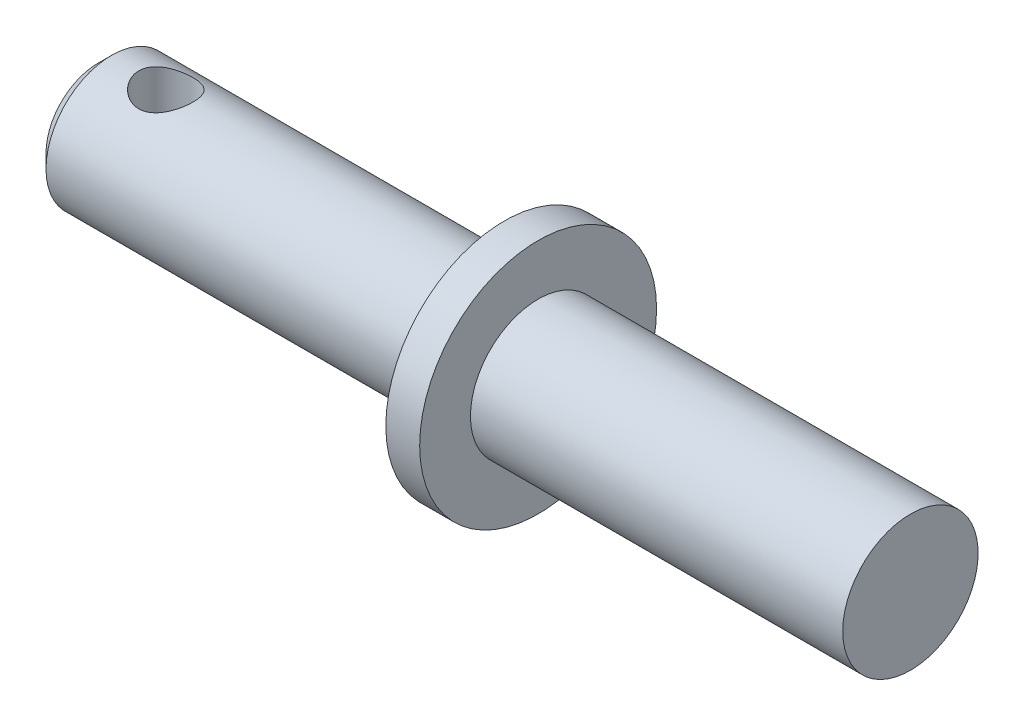
ISO-10303-21;
HEADER;
FILE_DESCRIPTION(('STEP AP214'),'2;1');
FILE_NAME('part.step','',(''),(''),'','','');
FILE_SCHEMA(('AUTOMOTIVE_DESIGN { 1 0 10303 214 1 1 1 1 }'));
ENDSEC;
DATA;
#1=APPLICATION_CONTEXT('core data for automotive mechanical design processes');
#2=APPLICATION_PROTOCOL_DEFINITION('international standard','automotive_design',2000,#1);
#3=PRODUCT_CONTEXT('',#1,'mechanical');
#4=PRODUCT('Part','Part','',(#3));
#5=PRODUCT_RELATED_PRODUCT_CATEGORY('part','',(#4));
#6=PRODUCT_DEFINITION_FORMATION('','',#4);
#7=PRODUCT_DEFINITION_CONTEXT('part definition',#1,'design');
#8=PRODUCT_DEFINITION('design','',#6,#7);
#9=PRODUCT_DEFINITION_SHAPE('','',#8);
#10=(LENGTH_UNIT() NAMED_UNIT(*) SI_UNIT(.MILLI.,.METRE.));
#11=(NAMED_UNIT(*) PLANE_ANGLE_UNIT() SI_UNIT($,.RADIAN.));
#12=(NAMED_UNIT(*) SI_UNIT($,.STERADIAN.) SOLID_ANGLE_UNIT());
#13=UNCERTAINTY_MEASURE_WITH_UNIT(LENGTH_MEASURE(1.E-05),#10,'distance_accuracy_value','');
#14=(GEOMETRIC_REPRESENTATION_CONTEXT(3) GLOBAL_UNCERTAINTY_ASSIGNED_CONTEXT((#13)) GLOBAL_UNIT_ASSIGNED_CONTEXT((#10,
#11,#12)) REPRESENTATION_CONTEXT('',''));
#15=CARTESIAN_POINT('',(0.,0.,0.));
#16=DIRECTION('',(0.,0.,1.));
#17=DIRECTION('',(1.,0.,0.));
#18=AXIS2_PLACEMENT_3D('',#15,#16,#17);
#19=CARTESIAN_POINT('',(55.,0.,0.));
#20=DIRECTION('',(-1.,0.,0.));
#21=DIRECTION('',(0.,0.,1.));
#22=AXIS2_PLACEMENT_3D('',#19,#20,#21);
#23=PLANE('',#22);
#24=CARTESIAN_POINT('',(55.,0.,0.));
#25=DIRECTION('',(-1.,0.,0.));
#26=DIRECTION('',(0.,0.,1.));
#27=AXIS2_PLACEMENT_3D('',#24,#25,#26);
#28=CIRCLE('',#27,10.);
#29=CARTESIAN_POINT('',(55.,0.,10.));
#30=VERTEX_POINT('',#29);
#31=EDGE_CURVE('E50',#30,#30,#28,.T.);
#32=ORIENTED_EDGE('',*,*,#31,.F.);
#33=EDGE_LOOP('',(#32));
#34=FACE_BOUND('',#33,.T.);
#35=ADVANCED_FACE('F33',(#34),#23,.F.);
#36=CARTESIAN_POINT('',(0.,0.,0.));
#37=DIRECTION('',(-1.,0.,0.));
#38=DIRECTION('',(0.,0.,1.));
#39=AXIS2_PLACEMENT_3D('',#36,#37,#38);
#40=CYLINDRICAL_SURFACE('',#39,10.);
#41=CARTESIAN_POINT('',(0.,0.,0.));
#42=DIRECTION('',(-1.,0.,0.));
#43=DIRECTION('',(0.,0.,1.));
#44=AXIS2_PLACEMENT_3D('',#41,#42,#43);
#45=CIRCLE('',#44,10.);
#46=CARTESIAN_POINT('',(0.,0.,10.));
#47=VERTEX_POINT('',#46);
#48=EDGE_CURVE('E108',#47,#47,#45,.T.);
#49=ORIENTED_EDGE('',*,*,#48,.F.);
#50=EDGE_LOOP('',(#49));
#51=FACE_BOUND('',#50,.T.);
#52=ORIENTED_EDGE('',*,*,#31,.T.);
#53=EDGE_LOOP('',(#52));
#54=FACE_BOUND('',#53,.T.);
#55=ADVANCED_FACE('F81',(#51,#54),#40,.T.);
#56=CARTESIAN_POINT('',(0.,10.,0.));
#57=DIRECTION('',(-1.,0.,0.));
#58=DIRECTION('',(0.,0.,1.));
#59=AXIS2_PLACEMENT_3D('',#56,#57,#58);
#60=PLANE('',#59);
#61=CARTESIAN_POINT('',(0.,0.,0.));
#62=DIRECTION('',(-1.,0.,0.));
#63=DIRECTION('',(0.,0.,1.));
#64=AXIS2_PLACEMENT_3D('',#61,#62,#63);
#65=CIRCLE('',#64,17.5);
#66=CARTESIAN_POINT('',(0.,0.,17.5));
#67=VERTEX_POINT('',#66);
#68=EDGE_CURVE('E104',#67,#67,#65,.T.);
#69=ORIENTED_EDGE('',*,*,#68,.F.);
#70=EDGE_LOOP('',(#69));
#71=FACE_BOUND('',#70,.T.);
#72=ORIENTED_EDGE('',*,*,#48,.T.);
#73=EDGE_LOOP('',(#72));
#74=FACE_BOUND('',#73,.T.);
#75=ADVANCED_FACE('F86',(#71,#74),#60,.F.);
#76=CARTESIAN_POINT('',(0.,0.,0.));
#77=DIRECTION('',(-1.,0.,0.));
#78=DIRECTION('',(0.,0.,1.));
#79=AXIS2_PLACEMENT_3D('',#76,#77,#78);
#80=CYLINDRICAL_SURFACE('',#79,17.5);
#81=CARTESIAN_POINT('',(-5.,0.,0.));
#82=DIRECTION('',(-1.,0.,0.));
#83=DIRECTION('',(0.,0.,1.));
#84=AXIS2_PLACEMENT_3D('',#81,#82,#83);
#85=CIRCLE('',#84,17.5);
#86=CARTESIAN_POINT('',(-5.,0.,17.5));
#87=VERTEX_POINT('',#86);
#88=EDGE_CURVE('E103',#87,#87,#85,.T.);
#89=ORIENTED_EDGE('',*,*,#88,.F.);
#90=EDGE_LOOP('',(#89));
#91=FACE_BOUND('',#90,.T.);
#92=ORIENTED_EDGE('',*,*,#68,.T.);
#93=EDGE_LOOP('',(#92));
#94=FACE_BOUND('',#93,.T.);
#95=ADVANCED_FACE('F93',(#91,#94),#80,.T.);
#96=CARTESIAN_POINT('',(-5.,17.5,0.));
#97=DIRECTION('',(1.,0.,0.));
#98=DIRECTION('',(0.,0.,-1.));
#99=AXIS2_PLACEMENT_3D('',#96,#97,#98);
#100=PLANE('',#99);
#101=CARTESIAN_POINT('',(-5.,0.,0.));
#102=DIRECTION('',(1.,0.,0.));
#103=DIRECTION('',(0.,0.,-1.));
#104=AXIS2_PLACEMENT_3D('',#101,#102,#103);
#105=CIRCLE('',#104,11.7);
#106=CARTESIAN_POINT('',(-5.,0.,-11.7));
#107=VERTEX_POINT('',#106);
#108=EDGE_CURVE('E10',#107,#107,#105,.T.);
#109=ORIENTED_EDGE('',*,*,#108,.T.);
#110=EDGE_LOOP('',(#109));
#111=FACE_BOUND('',#110,.T.);
#112=ORIENTED_EDGE('',*,*,#88,.T.);
#113=EDGE_LOOP('',(#112));
#114=FACE_BOUND('',#113,.T.);
#115=ADVANCED_FACE('F76',(#111,#114),#100,.F.);
#116=CARTESIAN_POINT('',(0.,0.,0.));
#117=DIRECTION('',(-1.,0.,0.));
#118=DIRECTION('',(0.,0.,1.));
#119=AXIS2_PLACEMENT_3D('',#116,#117,#118);
#120=CYLINDRICAL_SURFACE('',#119,9.7);
#121=CARTESIAN_POINT('',(-55.,-8.83685464404614,4.00000000000001));
#122=CARTESIAN_POINT('',(-54.8931655345799,-8.83685539071171,3.99999926019805));
#123=CARTESIAN_POINT('',(-54.7862915122197,-8.83879884622312,3.99571344302812));
#124=CARTESIAN_POINT('',(-54.573320446605,-8.84650852540039,3.97861431369307));
#125=CARTESIAN_POINT('',(-54.467223964212,-8.85227727749158,3.96579536131746));
#126=CARTESIAN_POINT('',(-54.2564130366367,-8.86746037549321,3.93172941015389));
#127=CARTESIAN_POINT('',(-54.1517020614631,-8.876882548907,3.91046431299247));
#128=CARTESIAN_POINT('',(-53.9446305755941,-8.89905482181608,3.85973842491083));
#129=CARTESIAN_POINT('',(-53.8422710722929,-8.91180631973117,3.83027418975473));
#130=CARTESIAN_POINT('',(-53.5406635166685,-8.9543460039205,3.73027819924711));
#131=CARTESIAN_POINT('',(-53.3457949723266,-8.9885045829879,3.64796367943371));
#132=CARTESIAN_POINT('',(-52.9727920982351,-9.06455059588731,3.45465547089905));
#133=CARTESIAN_POINT('',(-52.7946535857664,-9.10643609008867,3.34366897669941));
#134=CARTESIAN_POINT('',(-52.4490710477183,-9.19607945518412,3.0889023493782));
#135=CARTESIAN_POINT('',(-52.2827613195083,-9.24403390238144,2.94364939880747));
#136=CARTESIAN_POINT('',(-51.9760319944956,-9.33879295938546,2.62757540468048));
#137=CARTESIAN_POINT('',(-51.8356222612639,-9.38559712526979,2.45674466494561));
#138=CARTESIAN_POINT('',(-51.5789182626702,-9.47516239750484,2.08548032940123));
#139=CARTESIAN_POINT('',(-51.4638964385591,-9.51766848646517,1.88409972595102));
#140=CARTESIAN_POINT('',(-51.2698527222605,-9.59144978990466,1.46277923731868));
#141=CARTESIAN_POINT('',(-51.1908151597202,-9.6227298917949,1.24284748030687));
#142=CARTESIAN_POINT('',(-51.0750825636195,-9.66914224051161,0.802587568527286));
#143=CARTESIAN_POINT('',(-51.0364303160131,-9.68501792393713,0.582853887256973));
#144=CARTESIAN_POINT('',(-50.9962472104536,-9.70152966501042,0.139484426442429));
#145=CARTESIAN_POINT('',(-50.9947016207668,-9.70217177054775,-0.0841497692671025));
#146=CARTESIAN_POINT('',(-51.0277376702542,-9.68858555279882,-0.514762665159368));
#147=CARTESIAN_POINT('',(-51.060170415552,-9.67524172062196,-0.72193931392289));
#148=CARTESIAN_POINT('',(-51.1565662914511,-9.63639175490031,-1.12760455253048));
#149=CARTESIAN_POINT('',(-51.2205317438304,-9.61088472577428,-1.32609250144682));
#150=CARTESIAN_POINT('',(-51.378945517721,-9.54969293059947,-1.71237318630907));
#151=CARTESIAN_POINT('',(-51.473843034138,-9.51385914725793,-1.89995712466753));
#152=CARTESIAN_POINT('',(-51.6909922675759,-9.43553336185479,-2.25702778903753));
#153=CARTESIAN_POINT('',(-51.81325358394,-9.39303902481281,-2.42650813333022));
#154=CARTESIAN_POINT('',(-52.0915103921294,-9.30219637906277,-2.75502682698078));
#155=CARTESIAN_POINT('',(-52.249255479489,-9.25364646672562,-2.91252968665507));
#156=CARTESIAN_POINT('',(-52.5890504268246,-9.15838997563866,-3.19950058964693));
#157=CARTESIAN_POINT('',(-52.7711092436425,-9.11168408445551,-3.32895825519688));
#158=CARTESIAN_POINT('',(-53.1616533975887,-9.02398214349279,-3.55999145736764));
#159=CARTESIAN_POINT('',(-53.3707924508319,-8.98321341583413,-3.66055559621726));
#160=CARTESIAN_POINT('',(-53.8051653823205,-8.91469746522334,-3.8244150754856));
#161=CARTESIAN_POINT('',(-54.0303879042599,-8.88694115712285,-3.8877364263539));
#162=CARTESIAN_POINT('',(-54.4751644585314,-8.84983300267486,-3.97145240355067));
#163=CARTESIAN_POINT('',(-54.6941605939064,-8.83941813594548,-3.99433222029148));
#164=CARTESIAN_POINT('',(-55.1330633276284,-8.83513564997973,-4.00380184036867));
#165=CARTESIAN_POINT('',(-55.3529695970309,-8.84126249855531,-3.99040377642417));
#166=CARTESIAN_POINT('',(-55.7730598177206,-8.86827668929561,-3.9299646449856));
#167=CARTESIAN_POINT('',(-55.973620156486,-8.88822312409221,-3.88506596200802));
#168=CARTESIAN_POINT('',(-56.3642042164649,-8.93943580302155,-3.76572335750701));
#169=CARTESIAN_POINT('',(-56.5542254967007,-8.97070465704666,-3.69127262365978));
#170=CARTESIAN_POINT('',(-56.9272322701049,-9.04263726458148,-3.51147165802383));
#171=CARTESIAN_POINT('',(-57.1095891486223,-9.08363983098748,-3.40495721613544));
#172=CARTESIAN_POINT('',(-57.4547055729779,-9.16992930654773,-3.16521886405497));
#173=CARTESIAN_POINT('',(-57.6174567156518,-9.2152180380393,-3.03198356584181));
#174=CARTESIAN_POINT('',(-57.9321900123714,-9.30931821254773,-2.73010767271066));
#175=CARTESIAN_POINT('',(-58.0822903087009,-9.35812376639696,-2.55949556555557));
#176=CARTESIAN_POINT('',(-58.3520563693058,-9.45040666979244,-2.194364216394));
#177=CARTESIAN_POINT('',(-58.4717201736473,-9.49388367611772,-1.99984343600315));
#178=CARTESIAN_POINT('',(-58.6769985938652,-9.5708528786551,-1.59123161672252));
#179=CARTESIAN_POINT('',(-58.7625520562813,-9.60432711510564,-1.37710626778354));
#180=CARTESIAN_POINT('',(-58.8958157424754,-9.65730826219985,-0.935771321707205));
#181=CARTESIAN_POINT('',(-58.943547974991,-9.67682329526809,-0.708569416707048));
#182=CARTESIAN_POINT('',(-58.9970839825731,-9.69877036810467,-0.264371336927362));
#183=CARTESIAN_POINT('',(-59.0055429736757,-9.70228390963478,-0.0477463583772202));
#184=CARTESIAN_POINT('',(-58.9873977263971,-9.69480610504578,0.383750781157836));
#185=CARTESIAN_POINT('',(-58.9607994144267,-9.68381721055225,0.598623232228204));
#186=CARTESIAN_POINT('',(-58.8751997820013,-9.64913081607958,1.01294998040998));
#187=CARTESIAN_POINT('',(-58.8173380120892,-9.62588090462119,1.21268026037882));
#188=CARTESIAN_POINT('',(-58.6720844915039,-9.56920829666027,1.59953427122543));
#189=CARTESIAN_POINT('',(-58.5846870728839,-9.5357836477287,1.78665557414392));
#190=CARTESIAN_POINT('',(-58.3784406618046,-9.46014040906171,2.15224509789639));
#191=CARTESIAN_POINT('',(-58.2583537208422,-9.41759387320134,2.32994543362578));
#192=CARTESIAN_POINT('',(-57.9919447368096,-9.32877193014667,2.66342709474749));
#193=CARTESIAN_POINT('',(-57.8456132037577,-9.28249517745852,2.81920045491043));
#194=CARTESIAN_POINT('',(-57.5194398516457,-9.18758042326375,3.11514101681564));
#195=CARTESIAN_POINT('',(-57.3380180608457,-9.13898968294822,3.25358501997513));
#196=CARTESIAN_POINT('',(-56.9528503799351,-9.04813631802634,3.49833677462571));
#197=CARTESIAN_POINT('',(-56.7490922396374,-9.00587719631631,3.60462677016798));
#198=CARTESIAN_POINT('',(-56.4316028443826,-8.95145931808575,3.73679096138944));
#199=CARTESIAN_POINT('',(-56.3241010502384,-8.9348477361538,3.77623111849589));
#200=CARTESIAN_POINT('',(-56.1056891445527,-8.90510406770992,3.84584993808123));
#201=CARTESIAN_POINT('',(-55.9947807270942,-8.89197028201153,3.87603312448833));
#202=CARTESIAN_POINT('',(-55.7707045370694,-8.86970019615469,3.92672676091953));
#203=CARTESIAN_POINT('',(-55.6575435729211,-8.86055333661003,3.94726277288367));
#204=CARTESIAN_POINT('',(-55.4296675586529,-8.84656466776187,3.97851617810888));
#205=CARTESIAN_POINT('',(-55.3149537951621,-8.84171949221531,3.98924124903097));
#206=CARTESIAN_POINT('',(-55.1666901783487,-8.8383636613631,3.99666466060437));
#207=CARTESIAN_POINT('',(-55.1333682399918,-8.83779813093379,3.99791507190571));
#208=CARTESIAN_POINT('',(-55.0666988195499,-8.83704350438491,3.99958286005309));
#209=CARTESIAN_POINT('',(-55.033351337284,-8.8368544109538,4.00000023094968));
#210=CARTESIAN_POINT('',(-55.,-8.83685464404614,4.00000000000001));
#211=B_SPLINE_CURVE_WITH_KNOTS('',3,(#121,#122,#123,#124,#125,#126,#127,#128,#129,#130,#131,
#132,#133,#134,#135,#136,#137,#138,#139,#140,#141,#142,#143,#144,#145,#146,#147,#148,#149,#150,
#151,#152,#153,#154,#155,#156,#157,#158,#159,#160,#161,#162,#163,#164,#165,#166,#167,#168,#169,
#170,#171,#172,#173,#174,#175,#176,#177,#178,#179,#180,#181,#182,#183,#184,#185,#186,#187,#188,
#189,#190,#191,#192,#193,#194,#195,#196,#197,#198,#199,#200,#201,#202,#203,#204,#205,#206,#207,
#208,#209,#210),.UNSPECIFIED.,.T.,.F.,(4,2,2,2,2,2,2,2,2,2,2,2,2,2,2,2,2,2,2,2,2,2,2,2,2,2,2,2,
2,2,2,2,2,2,2,2,2,2,2,2,2,2,2,2,4),(0.,0.320468357167389,0.641148747322611,0.962520030026208,
1.28402651642614,1.92375335753317,2.56331983069379,3.23821494086112,3.91336654504594,
4.61709812821776,5.32052295797298,5.98800494495418,6.6552219301775,7.28265048459879,
7.91012524397958,8.54715155742034,9.18440169378302,9.86577441104456,10.5473988325722,
11.2505824528888,11.9532743831732,12.6110496314308,13.2686049215104,13.8852983614237,
14.5021340438327,15.1448208341893,15.7877821121375,16.4818078292138,17.1758782262184,
17.8711874258033,18.5660917168412,19.2132558404512,19.8603105754798,20.485231175559,
21.1102717672422,21.763428783422,22.4168224575491,23.1136041927918,23.8107700024275,
24.157502079996,24.5040644368415,24.8497032609204,25.1950713695228,25.2951137284659,
25.3951568018947),.UNSPECIFIED.);
#212=CARTESIAN_POINT('',(-55.,-8.83685464404614,4.00000000000001));
#213=VERTEX_POINT('',#212);
#214=EDGE_CURVE('E37',#213,#213,#211,.T.);
#215=ORIENTED_EDGE('',*,*,#214,.T.);
#216=EDGE_LOOP('',(#215));
#217=FACE_BOUND('',#216,.T.);
#218=CARTESIAN_POINT('',(-55.,8.83685464404614,4.00000000000001));
#219=CARTESIAN_POINT('',(-55.1068344654201,8.83685539071171,3.99999926019805));
#220=CARTESIAN_POINT('',(-55.2137084877803,8.83879884622312,3.99571344302812));
#221=CARTESIAN_POINT('',(-55.426679553395,8.84650852540039,3.97861431369307));
#222=CARTESIAN_POINT('',(-55.532776035788,8.85227727749158,3.96579536131746));
#223=CARTESIAN_POINT('',(-55.7435869633633,8.86746037549321,3.93172941015389));
#224=CARTESIAN_POINT('',(-55.8482979385369,8.876882548907,3.91046431299247));
#225=CARTESIAN_POINT('',(-56.0553694244059,8.89905482181608,3.85973842491083));
#226=CARTESIAN_POINT('',(-56.1577289277071,8.91180631973117,3.83027418975473));
#227=CARTESIAN_POINT('',(-56.4593364833315,8.9543460039205,3.73027819924711));
#228=CARTESIAN_POINT('',(-56.6542050276734,8.9885045829879,3.64796367943371));
#229=CARTESIAN_POINT('',(-57.0272079017649,9.06455059588731,3.45465547089905));
#230=CARTESIAN_POINT('',(-57.2053464142336,9.10643609008867,3.34366897669941));
#231=CARTESIAN_POINT('',(-57.5509289522817,9.19607945518412,3.0889023493782));
#232=CARTESIAN_POINT('',(-57.7172386804917,9.24403390238144,2.94364939880747));
#233=CARTESIAN_POINT('',(-58.0239680055044,9.33879295938546,2.62757540468048));
#234=CARTESIAN_POINT('',(-58.1643777387361,9.38559712526979,2.45674466494561));
#235=CARTESIAN_POINT('',(-58.4210817373298,9.47516239750484,2.08548032940123));
#236=CARTESIAN_POINT('',(-58.5361035614409,9.51766848646517,1.88409972595102));
#237=CARTESIAN_POINT('',(-58.7301472777395,9.59144978990466,1.46277923731868));
#238=CARTESIAN_POINT('',(-58.8091848402798,9.6227298917949,1.24284748030687));
#239=CARTESIAN_POINT('',(-58.9249174363805,9.66914224051161,0.802587568527286));
#240=CARTESIAN_POINT('',(-58.9635696839869,9.68501792393713,0.582853887256973));
#241=CARTESIAN_POINT('',(-59.0037527895464,9.70152966501042,0.139484426442429));
#242=CARTESIAN_POINT('',(-59.0052983792332,9.70217177054775,-0.0841497692671025));
#243=CARTESIAN_POINT('',(-58.9722623297458,9.68858555279882,-0.514762665159368));
#244=CARTESIAN_POINT('',(-58.939829584448,9.67524172062196,-0.72193931392289));
#245=CARTESIAN_POINT('',(-58.8434337085489,9.63639175490031,-1.12760455253048));
#246=CARTESIAN_POINT('',(-58.7794682561696,9.61088472577428,-1.32609250144682));
#247=CARTESIAN_POINT('',(-58.621054482279,9.54969293059947,-1.71237318630907));
#248=CARTESIAN_POINT('',(-58.526156965862,9.51385914725793,-1.89995712466753));
#249=CARTESIAN_POINT('',(-58.3090077324241,9.43553336185479,-2.25702778903753));
#250=CARTESIAN_POINT('',(-58.18674641606,9.39303902481281,-2.42650813333022));
#251=CARTESIAN_POINT('',(-57.9084896078706,9.30219637906277,-2.75502682698078));
#252=CARTESIAN_POINT('',(-57.750744520511,9.25364646672562,-2.91252968665507));
#253=CARTESIAN_POINT('',(-57.4109495731754,9.15838997563866,-3.19950058964693));
#254=CARTESIAN_POINT('',(-57.2288907563575,9.11168408445551,-3.32895825519688));
#255=CARTESIAN_POINT('',(-56.8383466024113,9.02398214349279,-3.55999145736763));
#256=CARTESIAN_POINT('',(-56.6292075491681,8.98321341583413,-3.66055559621726));
#257=CARTESIAN_POINT('',(-56.1948346176795,8.91469746522334,-3.8244150754856));
#258=CARTESIAN_POINT('',(-55.9696120957401,8.88694115712285,-3.8877364263539));
#259=CARTESIAN_POINT('',(-55.5248355414686,8.84983300267486,-3.97145240355067));
#260=CARTESIAN_POINT('',(-55.3058394060936,8.83941813594548,-3.99433222029148));
#261=CARTESIAN_POINT('',(-54.8669366723716,8.83513564997973,-4.00380184036867));
#262=CARTESIAN_POINT('',(-54.6470304029691,8.84126249855531,-3.99040377642417));
#263=CARTESIAN_POINT('',(-54.2269401822794,8.86827668929561,-3.9299646449856));
#264=CARTESIAN_POINT('',(-54.026379843514,8.88822312409221,-3.88506596200802));
#265=CARTESIAN_POINT('',(-53.6357957835351,8.93943580302155,-3.76572335750701));
#266=CARTESIAN_POINT('',(-53.4457745032993,8.97070465704666,-3.69127262365978));
#267=CARTESIAN_POINT('',(-53.0727677298951,9.04263726458148,-3.51147165802383));
#268=CARTESIAN_POINT('',(-52.8904108513777,9.08363983098748,-3.40495721613544));
#269=CARTESIAN_POINT('',(-52.5452944270221,9.16992930654773,-3.16521886405497));
#270=CARTESIAN_POINT('',(-52.3825432843482,9.2152180380393,-3.03198356584181));
#271=CARTESIAN_POINT('',(-52.0678099876286,9.30931821254773,-2.73010767271066));
#272=CARTESIAN_POINT('',(-51.9177096912991,9.35812376639696,-2.55949556555557));
#273=CARTESIAN_POINT('',(-51.6479436306942,9.45040666979244,-2.194364216394));
#274=CARTESIAN_POINT('',(-51.5282798263527,9.49388367611772,-1.99984343600315));
#275=CARTESIAN_POINT('',(-51.3230014061348,9.5708528786551,-1.59123161672252));
#276=CARTESIAN_POINT('',(-51.2374479437187,9.60432711510564,-1.37710626778354));
#277=CARTESIAN_POINT('',(-51.1041842575246,9.65730826219985,-0.935771321707205));
#278=CARTESIAN_POINT('',(-51.056452025009,9.67682329526809,-0.708569416707048));
#279=CARTESIAN_POINT('',(-51.0029160174269,9.69877036810467,-0.264371336927362));
#280=CARTESIAN_POINT('',(-50.9944570263243,9.70228390963478,-0.0477463583772202));
#281=CARTESIAN_POINT('',(-51.0126022736029,9.69480610504578,0.383750781157836));
#282=CARTESIAN_POINT('',(-51.0392005855733,9.68381721055225,0.598623232228204));
#283=CARTESIAN_POINT('',(-51.1248002179987,9.64913081607958,1.01294998040998));
#284=CARTESIAN_POINT('',(-51.1826619879108,9.62588090462119,1.21268026037882));
#285=CARTESIAN_POINT('',(-51.3279155084961,9.56920829666027,1.59953427122543));
#286=CARTESIAN_POINT('',(-51.4153129271161,9.5357836477287,1.78665557414392));
#287=CARTESIAN_POINT('',(-51.6215593381954,9.46014040906171,2.15224509789639));
#288=CARTESIAN_POINT('',(-51.7416462791578,9.41759387320134,2.32994543362578));
#289=CARTESIAN_POINT('',(-52.0080552631904,9.32877193014667,2.66342709474749));
#290=CARTESIAN_POINT('',(-52.1543867962423,9.28249517745852,2.81920045491043));
#291=CARTESIAN_POINT('',(-52.4805601483543,9.18758042326375,3.11514101681565));
#292=CARTESIAN_POINT('',(-52.6619819391544,9.13898968294821,3.25358501997514));
#293=CARTESIAN_POINT('',(-53.0471496200649,9.04813631802634,3.49833677462572));
#294=CARTESIAN_POINT('',(-53.2509077603626,9.00587719631631,3.60462677016798));
#295=CARTESIAN_POINT('',(-53.5683971556174,8.95145931808575,3.73679096138944));
#296=CARTESIAN_POINT('',(-53.6758989497616,8.9348477361538,3.77623111849589));
#297=CARTESIAN_POINT('',(-53.8943108554473,8.90510406770992,3.84584993808123));
#298=CARTESIAN_POINT('',(-54.0052192729058,8.89197028201153,3.87603312448833));
#299=CARTESIAN_POINT('',(-54.2292954629306,8.86970019615469,3.92672676091953));
#300=CARTESIAN_POINT('',(-54.3424564270789,8.86055333661003,3.94726277288367));
#301=CARTESIAN_POINT('',(-54.5703324413471,8.84656466776187,3.97851617810888));
#302=CARTESIAN_POINT('',(-54.6850462048379,8.84171949221531,3.98924124903097));
#303=CARTESIAN_POINT('',(-54.8333098216513,8.8383636613631,3.99666466060437));
#304=CARTESIAN_POINT('',(-54.8666317600082,8.83779813093379,3.99791507190571));
#305=CARTESIAN_POINT('',(-54.9333011804501,8.83704350438491,3.99958286005309));
#306=CARTESIAN_POINT('',(-54.966648662716,8.8368544109538,4.00000023094968));
#307=CARTESIAN_POINT('',(-55.,8.83685464404614,4.00000000000001));
#308=B_SPLINE_CURVE_WITH_KNOTS('',3,(#218,#219,#220,#221,#222,#223,#224,#225,#226,#227,#228,
#229,#230,#231,#232,#233,#234,#235,#236,#237,#238,#239,#240,#241,#242,#243,#244,#245,#246,#247,
#248,#249,#250,#251,#252,#253,#254,#255,#256,#257,#258,#259,#260,#261,#262,#263,#264,#265,#266,
#267,#268,#269,#270,#271,#272,#273,#274,#275,#276,#277,#278,#279,#280,#281,#282,#283,#284,#285,
#286,#287,#288,#289,#290,#291,#292,#293,#294,#295,#296,#297,#298,#299,#300,#301,#302,#303,#304,
#305,#306,#307),.UNSPECIFIED.,.T.,.F.,(4,2,2,2,2,2,2,2,2,2,2,2,2,2,2,2,2,2,2,2,2,2,2,2,2,2,2,2,
2,2,2,2,2,2,2,2,2,2,2,2,2,2,2,2,4),(0.,0.320468357167382,0.641148747322604,0.962520030026201,
1.28402651642614,1.92375335753317,2.56331983069379,3.23821494086111,3.91336654504594,
4.61709812821776,5.32052295797298,5.98800494495418,6.6552219301775,7.28265048459878,
7.91012524397958,8.54715155742034,9.18440169378302,9.86577441104456,10.5473988325722,
11.2505824528888,11.9532743831732,12.6110496314308,13.2686049215104,13.8852983614237,
14.5021340438327,15.1448208341893,15.7877821121375,16.4818078292138,17.1758782262184,
17.8711874258033,18.5660917168412,19.2132558404512,19.8603105754798,20.485231175559,
21.1102717672422,21.763428783422,22.4168224575491,23.1136041927918,23.8107700024275,
24.157502079996,24.5040644368415,24.8497032609204,25.1950713695228,25.2951137284659,
25.3951568018947),.UNSPECIFIED.);
#309=CARTESIAN_POINT('',(-55.,8.83685464404614,4.00000000000001));
#310=VERTEX_POINT('',#309);
#311=EDGE_CURVE('E53',#310,#310,#308,.T.);
#312=ORIENTED_EDGE('',*,*,#311,.T.);
#313=EDGE_LOOP('',(#312));
#314=FACE_BOUND('',#313,.T.);
#315=CARTESIAN_POINT('',(-7.,0.,0.));
#316=DIRECTION('',(1.,0.,0.));
#317=DIRECTION('',(0.,0.,-1.));
#318=AXIS2_PLACEMENT_3D('',#315,#316,#317);
#319=CIRCLE('',#318,9.7);
#320=CARTESIAN_POINT('',(-7.,0.,-9.7));
#321=VERTEX_POINT('',#320);
#322=EDGE_CURVE('E45',#321,#321,#319,.F.);
#323=ORIENTED_EDGE('',*,*,#322,.T.);
#324=EDGE_LOOP('',(#323));
#325=FACE_BOUND('',#324,.T.);
#326=CARTESIAN_POINT('',(-63.,0.,0.));
#327=DIRECTION('',(-1.,0.,0.));
#328=DIRECTION('',(0.,0.,1.));
#329=AXIS2_PLACEMENT_3D('',#326,#327,#328);
#330=CIRCLE('',#329,9.69999999999999);
#331=CARTESIAN_POINT('',(-63.,0.,9.69999999999999));
#332=VERTEX_POINT('',#331);
#333=EDGE_CURVE('E105',#332,#332,#330,.T.);
#334=ORIENTED_EDGE('',*,*,#333,.F.);
#335=EDGE_LOOP('',(#334));
#336=FACE_BOUND('',#335,.T.);
#337=ADVANCED_FACE('F57',(#217,#314,#325,#336),#120,.T.);
#338=CARTESIAN_POINT('',(-63.,0.,0.));
#339=DIRECTION('',(1.,0.,0.));
#340=DIRECTION('',(0.,0.,-1.));
#341=AXIS2_PLACEMENT_3D('',#338,#339,#340);
#342=CONICAL_SURFACE('',#341,9.69999999999999,0.78539816339745);
#343=CARTESIAN_POINT('',(-65.,0.,0.));
#344=DIRECTION('',(-1.,0.,0.));
#345=DIRECTION('',(0.,0.,1.));
#346=AXIS2_PLACEMENT_3D('',#343,#344,#345);
#347=CIRCLE('',#346,7.69999999999998);
#348=CARTESIAN_POINT('',(-65.,0.,7.69999999999998));
#349=VERTEX_POINT('',#348);
#350=EDGE_CURVE('E111',#349,#349,#347,.T.);
#351=ORIENTED_EDGE('',*,*,#350,.F.);
#352=EDGE_LOOP('',(#351));
#353=FACE_BOUND('',#352,.T.);
#354=ORIENTED_EDGE('',*,*,#333,.T.);
#355=EDGE_LOOP('',(#354));
#356=FACE_BOUND('',#355,.T.);
#357=ADVANCED_FACE('F69',(#353,#356),#342,.T.);
#358=CARTESIAN_POINT('',(-65.,7.69999999999998,0.));
#359=DIRECTION('',(1.,0.,0.));
#360=DIRECTION('',(0.,0.,-1.));
#361=AXIS2_PLACEMENT_3D('',#358,#359,#360);
#362=PLANE('',#361);
#363=ORIENTED_EDGE('',*,*,#350,.T.);
#364=EDGE_LOOP('',(#363));
#365=FACE_BOUND('',#364,.T.);
#366=ADVANCED_FACE('F66',(#365),#362,.F.);
#367=CARTESIAN_POINT('',(-7.,0.,0.));
#368=DIRECTION('',(1.,0.,0.));
#369=DIRECTION('',(0.,0.,-1.));
#370=AXIS2_PLACEMENT_3D('',#367,#368,#369);
#371=TOROIDAL_SURFACE('',#370,11.7,2.);
#372=ORIENTED_EDGE('',*,*,#108,.F.);
#373=EDGE_LOOP('',(#372));
#374=FACE_BOUND('',#373,.T.);
#375=ORIENTED_EDGE('',*,*,#322,.F.);
#376=EDGE_LOOP('',(#375));
#377=FACE_BOUND('',#376,.T.);
#378=ADVANCED_FACE('F35',(#374,#377),#371,.F.);
#379=CARTESIAN_POINT('',(-55.,-17.5,0.));
#380=DIRECTION('',(0.,1.,0.));
#381=DIRECTION('',(0.,0.,1.));
#382=AXIS2_PLACEMENT_3D('',#379,#380,#381);
#383=CYLINDRICAL_SURFACE('',#382,4.00000000000001);
#384=ORIENTED_EDGE('',*,*,#311,.F.);
#385=EDGE_LOOP('',(#384));
#386=FACE_BOUND('',#385,.T.);
#387=ORIENTED_EDGE('',*,*,#214,.F.);
#388=EDGE_LOOP('',(#387));
#389=FACE_BOUND('',#388,.T.);
#390=ADVANCED_FACE('F61',(#386,#389),#383,.F.);
#391=CLOSED_SHELL('',(#35,#55,#75,#95,#115,#337,#357,#366,#378,#390));
#392=MANIFOLD_SOLID_BREP('B2',#391);
#393=ADVANCED_BREP_SHAPE_REPRESENTATION('',(#18,#392),#14);
#394=SHAPE_DEFINITION_REPRESENTATION(#9,#393);
ENDSEC;
END-ISO-10303-21;
